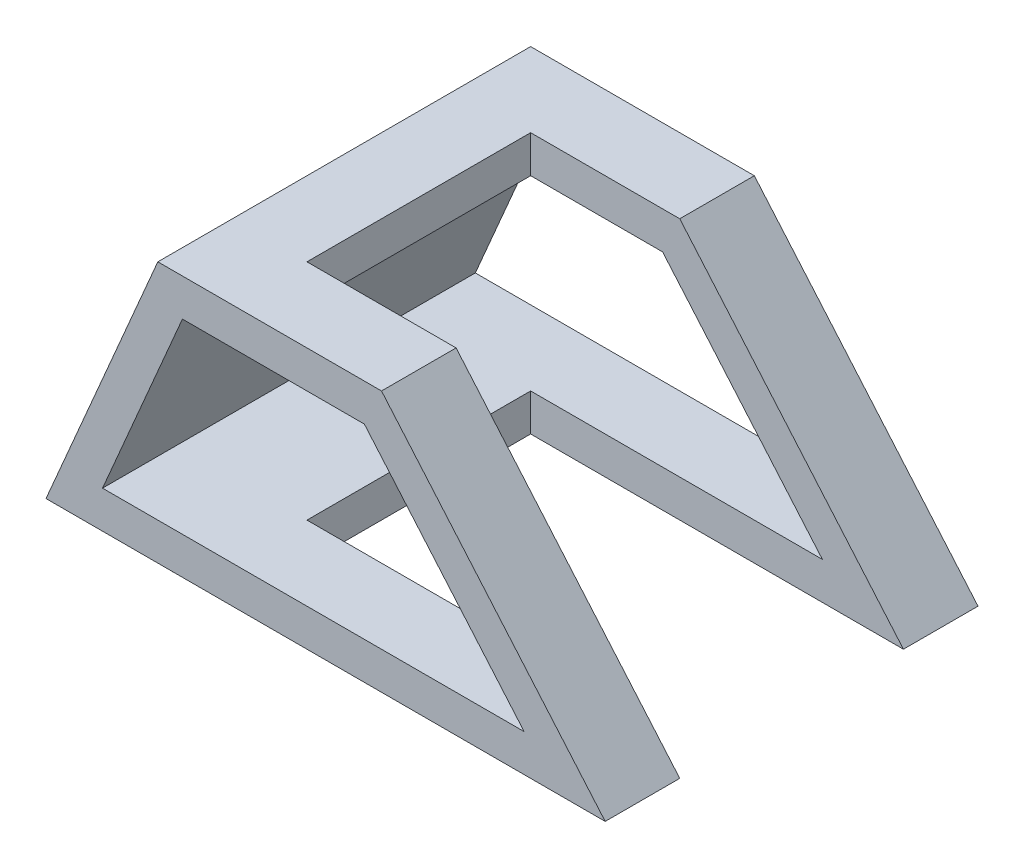
ISO-10303-21;
HEADER;
FILE_DESCRIPTION(('STEP AP214'),'2;1');
FILE_NAME('part.step','',(''),(''),'','','');
FILE_SCHEMA(('AUTOMOTIVE_DESIGN { 1 0 10303 214 1 1 1 1 }'));
ENDSEC;
DATA;
#1=APPLICATION_CONTEXT('core data for automotive mechanical design processes');
#2=APPLICATION_PROTOCOL_DEFINITION('international standard','automotive_design',2000,#1);
#3=PRODUCT_CONTEXT('',#1,'mechanical');
#4=PRODUCT('Part','Part','',(#3));
#5=PRODUCT_RELATED_PRODUCT_CATEGORY('part','',(#4));
#6=PRODUCT_DEFINITION_FORMATION('','',#4);
#7=PRODUCT_DEFINITION_CONTEXT('part definition',#1,'design');
#8=PRODUCT_DEFINITION('design','',#6,#7);
#9=PRODUCT_DEFINITION_SHAPE('','',#8);
#10=(LENGTH_UNIT() NAMED_UNIT(*) SI_UNIT(.MILLI.,.METRE.));
#11=(NAMED_UNIT(*) PLANE_ANGLE_UNIT() SI_UNIT($,.RADIAN.));
#12=(NAMED_UNIT(*) SI_UNIT($,.STERADIAN.) SOLID_ANGLE_UNIT());
#13=UNCERTAINTY_MEASURE_WITH_UNIT(LENGTH_MEASURE(1.E-05),#10,'distance_accuracy_value','');
#14=(GEOMETRIC_REPRESENTATION_CONTEXT(3) GLOBAL_UNCERTAINTY_ASSIGNED_CONTEXT((#13)) GLOBAL_UNIT_ASSIGNED_CONTEXT((#10,
#11,#12)) REPRESENTATION_CONTEXT('',''));
#15=CARTESIAN_POINT('',(0.,0.,0.));
#16=DIRECTION('',(0.,0.,1.));
#17=DIRECTION('',(1.,0.,0.));
#18=AXIS2_PLACEMENT_3D('',#15,#16,#17);
#19=CARTESIAN_POINT('',(150.,0.,-100.));
#20=DIRECTION('',(0.759256602365297,0.650791373455968,0.));
#21=DIRECTION('',(-0.650791373455968,0.759256602365297,0.));
#22=AXIS2_PLACEMENT_3D('',#19,#20,#21);
#23=PLANE('',#22);
#24=DIRECTION('',(-0.650791373455968,0.759256602365297,0.));
#25=VECTOR('',#24,1.);
#26=CARTESIAN_POINT('',(150.000494117647,-0.000576470588235871,-20.));
#27=LINE('',#26,#25);
#28=CARTESIAN_POINT('',(150.,0.,-20.));
#29=VERTEX_POINT('',#28);
#30=CARTESIAN_POINT('',(90.,70.,-20.));
#31=VERTEX_POINT('',#30);
#32=EDGE_CURVE('E166',#29,#31,#27,.T.);
#33=ORIENTED_EDGE('',*,*,#32,.T.);
#34=DIRECTION('',(0.,0.,1.));
#35=VECTOR('',#34,1.);
#36=CARTESIAN_POINT('',(90.,70.,-100.));
#37=LINE('',#36,#35);
#38=CARTESIAN_POINT('',(90.,70.,0.));
#39=VERTEX_POINT('',#38);
#40=EDGE_CURVE('E180',#31,#39,#37,.T.);
#41=ORIENTED_EDGE('',*,*,#40,.T.);
#42=DIRECTION('',(-0.650791373455968,0.759256602365297,0.));
#43=VECTOR('',#42,1.);
#44=CARTESIAN_POINT('',(150.,0.,0.));
#45=LINE('',#44,#43);
#46=CARTESIAN_POINT('',(150.,0.,0.));
#47=VERTEX_POINT('',#46);
#48=EDGE_CURVE('E197',#47,#39,#45,.T.);
#49=ORIENTED_EDGE('',*,*,#48,.F.);
#50=DIRECTION('',(0.,0.,1.));
#51=VECTOR('',#50,1.);
#52=CARTESIAN_POINT('',(150.,0.,-100.));
#53=LINE('',#52,#51);
#54=EDGE_CURVE('E182',#29,#47,#53,.T.);
#55=ORIENTED_EDGE('',*,*,#54,.F.);
#56=EDGE_LOOP('',(#33,#41,#49,#55));
#57=FACE_BOUND('',#56,.T.);
#58=ADVANCED_FACE('F48',(#57),#23,.T.);
#59=CARTESIAN_POINT('',(128.257793632439,10.,-100.));
#60=DIRECTION('',(0.759256602365297,0.650791373455968,0.));
#61=DIRECTION('',(-0.650791373455968,0.759256602365297,0.));
#62=AXIS2_PLACEMENT_3D('',#59,#60,#61);
#63=PLANE('',#62);
#64=DIRECTION('',(0.,0.,1.));
#65=VECTOR('',#64,1.);
#66=CARTESIAN_POINT('',(85.4006507752958,60.,-100.));
#67=LINE('',#66,#65);
#68=CARTESIAN_POINT('',(85.4006507752958,60.,-20.));
#69=VERTEX_POINT('',#68);
#70=CARTESIAN_POINT('',(85.4006507752958,60.,0.));
#71=VERTEX_POINT('',#70);
#72=EDGE_CURVE('E227',#69,#71,#67,.T.);
#73=ORIENTED_EDGE('',*,*,#72,.F.);
#74=DIRECTION('',(-0.650791373455968,0.759256602365297,0.));
#75=VECTOR('',#74,1.);
#76=CARTESIAN_POINT('',(142.407928093994,-6.50849020514793,-20.));
#77=LINE('',#76,#75);
#78=CARTESIAN_POINT('',(128.257793632439,10.,-20.));
#79=VERTEX_POINT('',#78);
#80=EDGE_CURVE('E276',#79,#69,#77,.T.);
#81=ORIENTED_EDGE('',*,*,#80,.F.);
#82=DIRECTION('',(0.,0.,1.));
#83=VECTOR('',#82,1.);
#84=CARTESIAN_POINT('',(128.257793632439,10.,-100.));
#85=LINE('',#84,#83);
#86=CARTESIAN_POINT('',(128.257793632439,10.,0.));
#87=VERTEX_POINT('',#86);
#88=EDGE_CURVE('E223',#79,#87,#85,.T.);
#89=ORIENTED_EDGE('',*,*,#88,.T.);
#90=DIRECTION('',(-0.650791373455968,0.759256602365297,0.));
#91=VECTOR('',#90,1.);
#92=CARTESIAN_POINT('',(128.257793632439,10.,0.));
#93=LINE('',#92,#91);
#94=EDGE_CURVE('E230',#87,#71,#93,.T.);
#95=ORIENTED_EDGE('',*,*,#94,.T.);
#96=EDGE_LOOP('',(#73,#81,#89,#95));
#97=FACE_BOUND('',#96,.T.);
#98=ADVANCED_FACE('F319',(#97),#63,.F.);
#99=CARTESIAN_POINT('',(30.,70.,-100.));
#100=DIRECTION('',(-0.919145030018058,0.393919298579168,0.));
#101=DIRECTION('',(-0.393919298579168,-0.919145030018058,0.));
#102=AXIS2_PLACEMENT_3D('',#99,#100,#101);
#103=PLANE('',#102);
#104=DIRECTION('',(-0.393919298579168,-0.919145030018058,0.));
#105=VECTOR('',#104,1.);
#106=CARTESIAN_POINT('',(30.,70.,0.));
#107=LINE('',#106,#105);
#108=CARTESIAN_POINT('',(30.,70.,0.));
#109=VERTEX_POINT('',#108);
#110=CARTESIAN_POINT('',(0.,0.,0.));
#111=VERTEX_POINT('',#110);
#112=EDGE_CURVE('E202',#109,#111,#107,.T.);
#113=ORIENTED_EDGE('',*,*,#112,.F.);
#114=DIRECTION('',(0.,0.,1.));
#115=VECTOR('',#114,1.);
#116=CARTESIAN_POINT('',(30.,70.,-100.));
#117=LINE('',#116,#115);
#118=CARTESIAN_POINT('',(30.,70.,-100.));
#119=VERTEX_POINT('',#118);
#120=EDGE_CURVE('E11',#119,#109,#117,.T.);
#121=ORIENTED_EDGE('',*,*,#120,.F.);
#122=DIRECTION('',(-0.393919298579168,-0.919145030018058,0.));
#123=VECTOR('',#122,1.);
#124=CARTESIAN_POINT('',(30.,70.,-100.));
#125=LINE('',#124,#123);
#126=CARTESIAN_POINT('',(0.,0.,-100.));
#127=VERTEX_POINT('',#126);
#128=EDGE_CURVE('E196',#119,#127,#125,.T.);
#129=ORIENTED_EDGE('',*,*,#128,.T.);
#130=DIRECTION('',(0.,0.,1.));
#131=VECTOR('',#130,1.);
#132=CARTESIAN_POINT('',(0.,0.,-100.));
#133=LINE('',#132,#131);
#134=EDGE_CURVE('E52',#127,#111,#133,.T.);
#135=ORIENTED_EDGE('',*,*,#134,.T.);
#136=EDGE_LOOP('',(#113,#121,#129,#135));
#137=FACE_BOUND('',#136,.T.);
#138=ADVANCED_FACE('F50',(#137),#103,.T.);
#139=CARTESIAN_POINT('',(90.,70.,-100.));
#140=DIRECTION('',(0.,1.,0.));
#141=DIRECTION('',(-1.,0.,0.));
#142=AXIS2_PLACEMENT_3D('',#139,#140,#141);
#143=PLANE('',#142);
#144=DIRECTION('',(1.,0.,0.));
#145=VECTOR('',#144,1.);
#146=CARTESIAN_POINT('',(150.,70.,-20.));
#147=LINE('',#146,#145);
#148=CARTESIAN_POINT('',(50.,70.,-20.));
#149=VERTEX_POINT('',#148);
#150=EDGE_CURVE('E162',#149,#31,#147,.T.);
#151=ORIENTED_EDGE('',*,*,#150,.F.);
#152=DIRECTION('',(0.,0.,1.));
#153=VECTOR('',#152,1.);
#154=CARTESIAN_POINT('',(50.,70.,-80.));
#155=LINE('',#154,#153);
#156=CARTESIAN_POINT('',(50.,70.,-80.));
#157=VERTEX_POINT('',#156);
#158=EDGE_CURVE('E175',#157,#149,#155,.T.);
#159=ORIENTED_EDGE('',*,*,#158,.F.);
#160=DIRECTION('',(-1.,0.,0.));
#161=VECTOR('',#160,1.);
#162=CARTESIAN_POINT('',(150.,70.,-80.));
#163=LINE('',#162,#161);
#164=CARTESIAN_POINT('',(90.,70.,-80.));
#165=VERTEX_POINT('',#164);
#166=EDGE_CURVE('E265',#165,#157,#163,.T.);
#167=ORIENTED_EDGE('',*,*,#166,.F.);
#168=CARTESIAN_POINT('',(90.,70.,-100.));
#169=VERTEX_POINT('',#168);
#170=EDGE_CURVE('E57',#169,#165,#37,.T.);
#171=ORIENTED_EDGE('',*,*,#170,.F.);
#172=DIRECTION('',(-1.,0.,0.));
#173=VECTOR('',#172,1.);
#174=CARTESIAN_POINT('',(90.,70.,-100.));
#175=LINE('',#174,#173);
#176=EDGE_CURVE('E206',#169,#119,#175,.T.);
#177=ORIENTED_EDGE('',*,*,#176,.T.);
#178=ORIENTED_EDGE('',*,*,#120,.T.);
#179=DIRECTION('',(-1.,0.,0.));
#180=VECTOR('',#179,1.);
#181=CARTESIAN_POINT('',(90.,70.,0.));
#182=LINE('',#181,#180);
#183=EDGE_CURVE('E189',#39,#109,#182,.T.);
#184=ORIENTED_EDGE('',*,*,#183,.F.);
#185=ORIENTED_EDGE('',*,*,#40,.F.);
#186=EDGE_LOOP('',(#151,#159,#167,#171,#177,#178,#184,#185));
#187=FACE_BOUND('',#186,.T.);
#188=ADVANCED_FACE('F187',(#187),#143,.T.);
#189=DIRECTION('',(0.650791373455968,-0.759256602365297,0.));
#190=VECTOR('',#189,1.);
#191=CARTESIAN_POINT('',(150.000494117647,-0.000576470588235871,-80.));
#192=LINE('',#191,#190);
#193=CARTESIAN_POINT('',(150.,0.,-80.));
#194=VERTEX_POINT('',#193);
#195=EDGE_CURVE('E184',#165,#194,#192,.T.);
#196=ORIENTED_EDGE('',*,*,#195,.T.);
#197=CARTESIAN_POINT('',(150.,0.,-100.));
#198=VERTEX_POINT('',#197);
#199=EDGE_CURVE('E190',#198,#194,#53,.T.);
#200=ORIENTED_EDGE('',*,*,#199,.F.);
#201=DIRECTION('',(-0.650791373455968,0.759256602365297,0.));
#202=VECTOR('',#201,1.);
#203=CARTESIAN_POINT('',(150.,0.,-100.));
#204=LINE('',#203,#202);
#205=EDGE_CURVE('E209',#198,#169,#204,.T.);
#206=ORIENTED_EDGE('',*,*,#205,.T.);
#207=ORIENTED_EDGE('',*,*,#170,.T.);
#208=EDGE_LOOP('',(#196,#200,#206,#207));
#209=FACE_BOUND('',#208,.T.);
#210=ADVANCED_FACE('F284',(#209),#23,.T.);
#211=CARTESIAN_POINT('',(0.,0.,-100.));
#212=DIRECTION('',(0.,-1.,0.));
#213=DIRECTION('',(0.,0.,-1.));
#214=AXIS2_PLACEMENT_3D('',#211,#212,#213);
#215=PLANE('',#214);
#216=DIRECTION('',(1.,0.,0.));
#217=VECTOR('',#216,1.);
#218=CARTESIAN_POINT('',(150.,0.,-20.));
#219=LINE('',#218,#217);
#220=CARTESIAN_POINT('',(50.,0.,-20.));
#221=VERTEX_POINT('',#220);
#222=EDGE_CURVE('E268',#221,#29,#219,.T.);
#223=ORIENTED_EDGE('',*,*,#222,.T.);
#224=ORIENTED_EDGE('',*,*,#54,.T.);
#225=DIRECTION('',(1.,0.,0.));
#226=VECTOR('',#225,1.);
#227=CARTESIAN_POINT('',(0.,0.,0.));
#228=LINE('',#227,#226);
#229=EDGE_CURVE('E199',#111,#47,#228,.T.);
#230=ORIENTED_EDGE('',*,*,#229,.F.);
#231=ORIENTED_EDGE('',*,*,#134,.F.);
#232=DIRECTION('',(1.,0.,0.));
#233=VECTOR('',#232,1.);
#234=CARTESIAN_POINT('',(0.,0.,-100.));
#235=LINE('',#234,#233);
#236=EDGE_CURVE('E212',#127,#198,#235,.T.);
#237=ORIENTED_EDGE('',*,*,#236,.T.);
#238=ORIENTED_EDGE('',*,*,#199,.T.);
#239=DIRECTION('',(-1.,0.,0.));
#240=VECTOR('',#239,1.);
#241=CARTESIAN_POINT('',(150.,0.,-80.));
#242=LINE('',#241,#240);
#243=CARTESIAN_POINT('',(50.,0.,-80.));
#244=VERTEX_POINT('',#243);
#245=EDGE_CURVE('E242',#194,#244,#242,.T.);
#246=ORIENTED_EDGE('',*,*,#245,.T.);
#247=DIRECTION('',(0.,0.,1.));
#248=VECTOR('',#247,1.);
#249=CARTESIAN_POINT('',(50.,0.,-80.));
#250=LINE('',#249,#248);
#251=EDGE_CURVE('E65',#244,#221,#250,.T.);
#252=ORIENTED_EDGE('',*,*,#251,.T.);
#253=EDGE_LOOP('',(#223,#224,#230,#231,#237,#238,#246,#252));
#254=FACE_BOUND('',#253,.T.);
#255=ADVANCED_FACE('F288',(#254),#215,.T.);
#256=CARTESIAN_POINT('',(0.,0.,-100.));
#257=DIRECTION('',(0.,0.,1.));
#258=DIRECTION('',(1.,0.,0.));
#259=AXIS2_PLACEMENT_3D('',#256,#257,#258);
#260=PLANE('',#259);
#261=DIRECTION('',(-0.650791373455968,0.759256602365297,0.));
#262=VECTOR('',#261,1.);
#263=CARTESIAN_POINT('',(128.257793632439,10.,-100.));
#264=LINE('',#263,#262);
#265=CARTESIAN_POINT('',(128.257793632439,10.,-100.));
#266=VERTEX_POINT('',#265);
#267=CARTESIAN_POINT('',(85.4006507752958,60.,-100.));
#268=VERTEX_POINT('',#267);
#269=EDGE_CURVE('E221',#266,#268,#264,.T.);
#270=ORIENTED_EDGE('',*,*,#269,.T.);
#271=DIRECTION('',(-1.,0.,0.));
#272=VECTOR('',#271,1.);
#273=CARTESIAN_POINT('',(85.4006507752958,60.,-100.));
#274=LINE('',#273,#272);
#275=CARTESIAN_POINT('',(36.5939615798056,60.,-100.));
#276=VERTEX_POINT('',#275);
#277=EDGE_CURVE('E233',#268,#276,#274,.T.);
#278=ORIENTED_EDGE('',*,*,#277,.T.);
#279=DIRECTION('',(-0.393919298579167,-0.919145030018058,0.));
#280=VECTOR('',#279,1.);
#281=CARTESIAN_POINT('',(36.5939615798056,60.,-100.));
#282=LINE('',#281,#280);
#283=CARTESIAN_POINT('',(15.1653901512342,10.,-100.));
#284=VERTEX_POINT('',#283);
#285=EDGE_CURVE('E248',#276,#284,#282,.T.);
#286=ORIENTED_EDGE('',*,*,#285,.T.);
#287=DIRECTION('',(1.,0.,0.));
#288=VECTOR('',#287,1.);
#289=CARTESIAN_POINT('',(15.1653901512342,10.,-100.));
#290=LINE('',#289,#288);
#291=EDGE_CURVE('E245',#284,#266,#290,.T.);
#292=ORIENTED_EDGE('',*,*,#291,.T.);
#293=EDGE_LOOP('',(#270,#278,#286,#292));
#294=FACE_BOUND('',#293,.T.);
#295=ORIENTED_EDGE('',*,*,#128,.F.);
#296=ORIENTED_EDGE('',*,*,#176,.F.);
#297=ORIENTED_EDGE('',*,*,#205,.F.);
#298=ORIENTED_EDGE('',*,*,#236,.F.);
#299=EDGE_LOOP('',(#295,#296,#297,#298));
#300=FACE_BOUND('',#299,.T.);
#301=ADVANCED_FACE('F293',(#294,#300),#260,.F.);
#302=CARTESIAN_POINT('',(0.,0.,0.));
#303=DIRECTION('',(0.,0.,1.));
#304=DIRECTION('',(1.,0.,0.));
#305=AXIS2_PLACEMENT_3D('',#302,#303,#304);
#306=PLANE('',#305);
#307=DIRECTION('',(-1.,0.,0.));
#308=VECTOR('',#307,1.);
#309=CARTESIAN_POINT('',(85.4006507752958,60.,0.));
#310=LINE('',#309,#308);
#311=CARTESIAN_POINT('',(36.5939615798056,60.,0.));
#312=VERTEX_POINT('',#311);
#313=EDGE_CURVE('E240',#71,#312,#310,.T.);
#314=ORIENTED_EDGE('',*,*,#313,.F.);
#315=ORIENTED_EDGE('',*,*,#94,.F.);
#316=DIRECTION('',(1.,0.,0.));
#317=VECTOR('',#316,1.);
#318=CARTESIAN_POINT('',(15.1653901512342,10.,0.));
#319=LINE('',#318,#317);
#320=CARTESIAN_POINT('',(15.1653901512342,10.,0.));
#321=VERTEX_POINT('',#320);
#322=EDGE_CURVE('E234',#321,#87,#319,.T.);
#323=ORIENTED_EDGE('',*,*,#322,.F.);
#324=DIRECTION('',(-0.393919298579167,-0.919145030018058,0.));
#325=VECTOR('',#324,1.);
#326=CARTESIAN_POINT('',(36.5939615798056,60.,0.));
#327=LINE('',#326,#325);
#328=EDGE_CURVE('E237',#312,#321,#327,.T.);
#329=ORIENTED_EDGE('',*,*,#328,.F.);
#330=EDGE_LOOP('',(#314,#315,#323,#329));
#331=FACE_BOUND('',#330,.T.);
#332=ORIENTED_EDGE('',*,*,#112,.T.);
#333=ORIENTED_EDGE('',*,*,#229,.T.);
#334=ORIENTED_EDGE('',*,*,#48,.T.);
#335=ORIENTED_EDGE('',*,*,#183,.T.);
#336=EDGE_LOOP('',(#332,#333,#334,#335));
#337=FACE_BOUND('',#336,.T.);
#338=ADVANCED_FACE('F328',(#331,#337),#306,.T.);
#339=CARTESIAN_POINT('',(85.4006507752958,60.,-100.));
#340=DIRECTION('',(0.,1.,0.));
#341=DIRECTION('',(0.,0.,1.));
#342=AXIS2_PLACEMENT_3D('',#339,#340,#341);
#343=PLANE('',#342);
#344=DIRECTION('',(0.,0.,-1.));
#345=VECTOR('',#344,1.);
#346=CARTESIAN_POINT('',(50.,60.,-80.));
#347=LINE('',#346,#345);
#348=CARTESIAN_POINT('',(50.,60.,-20.));
#349=VERTEX_POINT('',#348);
#350=CARTESIAN_POINT('',(50.,60.,-80.));
#351=VERTEX_POINT('',#350);
#352=EDGE_CURVE('E273',#349,#351,#347,.T.);
#353=ORIENTED_EDGE('',*,*,#352,.F.);
#354=DIRECTION('',(-1.,0.,0.));
#355=VECTOR('',#354,1.);
#356=CARTESIAN_POINT('',(150.,60.,-20.));
#357=LINE('',#356,#355);
#358=EDGE_CURVE('E271',#69,#349,#357,.T.);
#359=ORIENTED_EDGE('',*,*,#358,.F.);
#360=ORIENTED_EDGE('',*,*,#72,.T.);
#361=ORIENTED_EDGE('',*,*,#313,.T.);
#362=DIRECTION('',(0.,0.,1.));
#363=VECTOR('',#362,1.);
#364=CARTESIAN_POINT('',(36.5939615798056,60.,-100.));
#365=LINE('',#364,#363);
#366=EDGE_CURVE('E217',#276,#312,#365,.T.);
#367=ORIENTED_EDGE('',*,*,#366,.F.);
#368=ORIENTED_EDGE('',*,*,#277,.F.);
#369=CARTESIAN_POINT('',(85.4006507752958,60.,-80.));
#370=VERTEX_POINT('',#369);
#371=EDGE_CURVE('E205',#268,#370,#67,.T.);
#372=ORIENTED_EDGE('',*,*,#371,.T.);
#373=DIRECTION('',(1.,0.,0.));
#374=VECTOR('',#373,1.);
#375=CARTESIAN_POINT('',(150.,60.,-80.));
#376=LINE('',#375,#374);
#377=EDGE_CURVE('E255',#351,#370,#376,.T.);
#378=ORIENTED_EDGE('',*,*,#377,.F.);
#379=EDGE_LOOP('',(#353,#359,#360,#361,#367,#368,#372,#378));
#380=FACE_BOUND('',#379,.T.);
#381=ADVANCED_FACE('F304',(#380),#343,.F.);
#382=CARTESIAN_POINT('',(128.257793632439,10.,-80.));
#383=VERTEX_POINT('',#382);
#384=EDGE_CURVE('E224',#266,#383,#85,.T.);
#385=ORIENTED_EDGE('',*,*,#384,.T.);
#386=DIRECTION('',(0.650791373455968,-0.759256602365297,0.));
#387=VECTOR('',#386,1.);
#388=CARTESIAN_POINT('',(142.407928093994,-6.50849020514793,-80.));
#389=LINE('',#388,#387);
#390=EDGE_CURVE('E73',#370,#383,#389,.T.);
#391=ORIENTED_EDGE('',*,*,#390,.F.);
#392=ORIENTED_EDGE('',*,*,#371,.F.);
#393=ORIENTED_EDGE('',*,*,#269,.F.);
#394=EDGE_LOOP('',(#385,#391,#392,#393));
#395=FACE_BOUND('',#394,.T.);
#396=ADVANCED_FACE('F308',(#395),#63,.F.);
#397=CARTESIAN_POINT('',(15.1653901512342,10.,-100.));
#398=DIRECTION('',(0.,-1.,0.));
#399=DIRECTION('',(1.,0.,0.));
#400=AXIS2_PLACEMENT_3D('',#397,#398,#399);
#401=PLANE('',#400);
#402=ORIENTED_EDGE('',*,*,#88,.F.);
#403=DIRECTION('',(1.,0.,0.));
#404=VECTOR('',#403,1.);
#405=CARTESIAN_POINT('',(150.,10.,-20.));
#406=LINE('',#405,#404);
#407=CARTESIAN_POINT('',(50.,10.,-20.));
#408=VERTEX_POINT('',#407);
#409=EDGE_CURVE('E278',#408,#79,#406,.T.);
#410=ORIENTED_EDGE('',*,*,#409,.F.);
#411=DIRECTION('',(0.,0.,1.));
#412=VECTOR('',#411,1.);
#413=CARTESIAN_POINT('',(50.,10.,-80.));
#414=LINE('',#413,#412);
#415=CARTESIAN_POINT('',(50.,10.,-80.));
#416=VERTEX_POINT('',#415);
#417=EDGE_CURVE('E183',#416,#408,#414,.T.);
#418=ORIENTED_EDGE('',*,*,#417,.F.);
#419=DIRECTION('',(-1.,0.,0.));
#420=VECTOR('',#419,1.);
#421=CARTESIAN_POINT('',(150.,10.,-80.));
#422=LINE('',#421,#420);
#423=EDGE_CURVE('E258',#383,#416,#422,.T.);
#424=ORIENTED_EDGE('',*,*,#423,.F.);
#425=ORIENTED_EDGE('',*,*,#384,.F.);
#426=ORIENTED_EDGE('',*,*,#291,.F.);
#427=DIRECTION('',(0.,0.,1.));
#428=VECTOR('',#427,1.);
#429=CARTESIAN_POINT('',(15.1653901512342,10.,-100.));
#430=LINE('',#429,#428);
#431=EDGE_CURVE('E220',#284,#321,#430,.T.);
#432=ORIENTED_EDGE('',*,*,#431,.T.);
#433=ORIENTED_EDGE('',*,*,#322,.T.);
#434=EDGE_LOOP('',(#402,#410,#418,#424,#425,#426,#432,#433));
#435=FACE_BOUND('',#434,.T.);
#436=ADVANCED_FACE('F311',(#435),#401,.F.);
#437=CARTESIAN_POINT('',(36.5939615798056,60.,-100.));
#438=DIRECTION('',(-0.919145030018058,0.393919298579168,0.));
#439=DIRECTION('',(-0.393919298579168,-0.919145030018058,0.));
#440=AXIS2_PLACEMENT_3D('',#437,#438,#439);
#441=PLANE('',#440);
#442=ORIENTED_EDGE('',*,*,#328,.T.);
#443=ORIENTED_EDGE('',*,*,#431,.F.);
#444=ORIENTED_EDGE('',*,*,#285,.F.);
#445=ORIENTED_EDGE('',*,*,#366,.T.);
#446=EDGE_LOOP('',(#442,#443,#444,#445));
#447=FACE_BOUND('',#446,.T.);
#448=ADVANCED_FACE('F326',(#447),#441,.F.);
#449=CARTESIAN_POINT('',(150.,-0.001000000000001,-20.));
#450=DIRECTION('',(0.,0.,1.));
#451=DIRECTION('',(1.,0.,0.));
#452=AXIS2_PLACEMENT_3D('',#449,#450,#451);
#453=PLANE('',#452);
#454=ORIENTED_EDGE('',*,*,#222,.F.);
#455=DIRECTION('',(0.,1.,0.));
#456=VECTOR('',#455,1.);
#457=CARTESIAN_POINT('',(50.,-0.00100000000002876,-20.));
#458=LINE('',#457,#456);
#459=EDGE_CURVE('E260',#221,#408,#458,.T.);
#460=ORIENTED_EDGE('',*,*,#459,.T.);
#461=ORIENTED_EDGE('',*,*,#409,.T.);
#462=ORIENTED_EDGE('',*,*,#80,.T.);
#463=ORIENTED_EDGE('',*,*,#358,.T.);
#464=EDGE_CURVE('E169',#349,#149,#458,.T.);
#465=ORIENTED_EDGE('',*,*,#464,.T.);
#466=ORIENTED_EDGE('',*,*,#150,.T.);
#467=ORIENTED_EDGE('',*,*,#32,.F.);
#468=EDGE_LOOP('',(#454,#460,#461,#462,#463,#465,#466,#467));
#469=FACE_BOUND('',#468,.T.);
#470=ADVANCED_FACE('F165',(#469),#453,.F.);
#471=CARTESIAN_POINT('',(50.,-0.00100000000002876,-80.));
#472=DIRECTION('',(-1.,0.,0.));
#473=DIRECTION('',(0.,-1.,0.));
#474=AXIS2_PLACEMENT_3D('',#471,#472,#473);
#475=PLANE('',#474);
#476=ORIENTED_EDGE('',*,*,#352,.T.);
#477=DIRECTION('',(0.,1.,0.));
#478=VECTOR('',#477,1.);
#479=CARTESIAN_POINT('',(50.,-0.00100000000002876,-80.));
#480=LINE('',#479,#478);
#481=EDGE_CURVE('E174',#351,#157,#480,.T.);
#482=ORIENTED_EDGE('',*,*,#481,.T.);
#483=ORIENTED_EDGE('',*,*,#158,.T.);
#484=ORIENTED_EDGE('',*,*,#464,.F.);
#485=EDGE_LOOP('',(#476,#482,#483,#484));
#486=FACE_BOUND('',#485,.T.);
#487=ADVANCED_FACE('F301',(#486),#475,.F.);
#488=EDGE_CURVE('E262',#244,#416,#480,.T.);
#489=ORIENTED_EDGE('',*,*,#488,.T.);
#490=ORIENTED_EDGE('',*,*,#417,.T.);
#491=ORIENTED_EDGE('',*,*,#459,.F.);
#492=ORIENTED_EDGE('',*,*,#251,.F.);
#493=EDGE_LOOP('',(#489,#490,#491,#492));
#494=FACE_BOUND('',#493,.T.);
#495=ADVANCED_FACE('F315',(#494),#475,.F.);
#496=CARTESIAN_POINT('',(150.,-0.001000000000001,-80.));
#497=DIRECTION('',(0.,0.,-1.));
#498=DIRECTION('',(-1.,0.,0.));
#499=AXIS2_PLACEMENT_3D('',#496,#497,#498);
#500=PLANE('',#499);
#501=ORIENTED_EDGE('',*,*,#166,.T.);
#502=ORIENTED_EDGE('',*,*,#481,.F.);
#503=ORIENTED_EDGE('',*,*,#377,.T.);
#504=ORIENTED_EDGE('',*,*,#390,.T.);
#505=ORIENTED_EDGE('',*,*,#423,.T.);
#506=ORIENTED_EDGE('',*,*,#488,.F.);
#507=ORIENTED_EDGE('',*,*,#245,.F.);
#508=ORIENTED_EDGE('',*,*,#195,.F.);
#509=EDGE_LOOP('',(#501,#502,#503,#504,#505,#506,#507,#508));
#510=FACE_BOUND('',#509,.T.);
#511=ADVANCED_FACE('F297',(#510),#500,.F.);
#512=CLOSED_SHELL('',(#58,#98,#138,#188,#210,#255,#301,#338,#381,#396,#436,#448,#470,#487,#495,#511));
#513=MANIFOLD_SOLID_BREP('B2',#512);
#514=ADVANCED_BREP_SHAPE_REPRESENTATION('',(#18,#513),#14);
#515=SHAPE_DEFINITION_REPRESENTATION(#9,#514);
ENDSEC;
END-ISO-10303-21;
